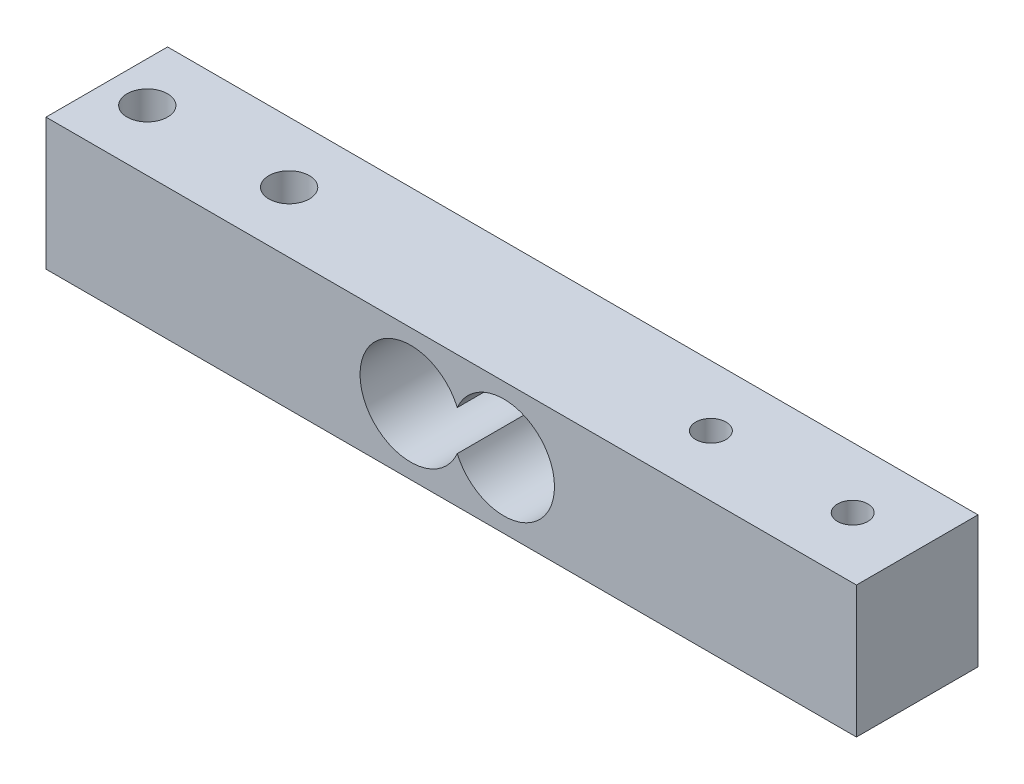
ISO-10303-21;
HEADER;
FILE_DESCRIPTION(('STEP AP214'),'2;1');
FILE_NAME('part.step','',(''),(''),'','','');
FILE_SCHEMA(('AUTOMOTIVE_DESIGN { 1 0 10303 214 1 1 1 1 }'));
ENDSEC;
DATA;
#1=APPLICATION_CONTEXT('core data for automotive mechanical design processes');
#2=APPLICATION_PROTOCOL_DEFINITION('international standard','automotive_design',2000,#1);
#3=PRODUCT_CONTEXT('',#1,'mechanical');
#4=PRODUCT('Part','Part','',(#3));
#5=PRODUCT_RELATED_PRODUCT_CATEGORY('part','',(#4));
#6=PRODUCT_DEFINITION_FORMATION('','',#4);
#7=PRODUCT_DEFINITION_CONTEXT('part definition',#1,'design');
#8=PRODUCT_DEFINITION('design','',#6,#7);
#9=PRODUCT_DEFINITION_SHAPE('','',#8);
#10=(LENGTH_UNIT() NAMED_UNIT(*) SI_UNIT(.MILLI.,.METRE.));
#11=(NAMED_UNIT(*) PLANE_ANGLE_UNIT() SI_UNIT($,.RADIAN.));
#12=(NAMED_UNIT(*) SI_UNIT($,.STERADIAN.) SOLID_ANGLE_UNIT());
#13=UNCERTAINTY_MEASURE_WITH_UNIT(LENGTH_MEASURE(1.E-05),#10,'distance_accuracy_value','');
#14=(GEOMETRIC_REPRESENTATION_CONTEXT(3) GLOBAL_UNCERTAINTY_ASSIGNED_CONTEXT((#13)) GLOBAL_UNIT_ASSIGNED_CONTEXT((#10,
#11,#12)) REPRESENTATION_CONTEXT('',''));
#15=CARTESIAN_POINT('',(0.,0.,0.));
#16=DIRECTION('',(0.,0.,1.));
#17=DIRECTION('',(1.,0.,0.));
#18=AXIS2_PLACEMENT_3D('',#15,#16,#17);
#19=CARTESIAN_POINT('',(-40.,13.,-6.));
#20=DIRECTION('',(0.,0.,1.));
#21=DIRECTION('',(1.,0.,0.));
#22=AXIS2_PLACEMENT_3D('',#19,#20,#21);
#23=PLANE('',#22);
#24=DIRECTION('',(-1.,0.,0.));
#25=VECTOR('',#24,1.);
#26=CARTESIAN_POINT('',(-40.,0.,-6.));
#27=LINE('',#26,#25);
#28=CARTESIAN_POINT('',(40.,0.,-6.));
#29=VERTEX_POINT('',#28);
#30=CARTESIAN_POINT('',(-40.,0.,-6.));
#31=VERTEX_POINT('',#30);
#32=EDGE_CURVE('E179',#29,#31,#27,.T.);
#33=ORIENTED_EDGE('',*,*,#32,.T.);
#34=DIRECTION('',(0.,-1.,0.));
#35=VECTOR('',#34,1.);
#36=CARTESIAN_POINT('',(-40.,13.,-6.));
#37=LINE('',#36,#35);
#38=CARTESIAN_POINT('',(-40.,13.,-6.));
#39=VERTEX_POINT('',#38);
#40=EDGE_CURVE('E194',#39,#31,#37,.T.);
#41=ORIENTED_EDGE('',*,*,#40,.F.);
#42=DIRECTION('',(-1.,0.,0.));
#43=VECTOR('',#42,1.);
#44=CARTESIAN_POINT('',(-40.,13.,-6.));
#45=LINE('',#44,#43);
#46=CARTESIAN_POINT('',(40.,13.,-6.));
#47=VERTEX_POINT('',#46);
#48=EDGE_CURVE('E165',#47,#39,#45,.T.);
#49=ORIENTED_EDGE('',*,*,#48,.F.);
#50=DIRECTION('',(0.,-1.,0.));
#51=VECTOR('',#50,1.);
#52=CARTESIAN_POINT('',(40.,13.,-6.));
#53=LINE('',#52,#51);
#54=EDGE_CURVE('E198',#47,#29,#53,.T.);
#55=ORIENTED_EDGE('',*,*,#54,.T.);
#56=EDGE_LOOP('',(#33,#41,#49,#55));
#57=FACE_BOUND('',#56,.T.);
#58=CARTESIAN_POINT('',(5.19354911457308,6.5,-6.));
#59=DIRECTION('',(0.,0.,1.));
#60=DIRECTION('',(1.,0.,0.));
#61=AXIS2_PLACEMENT_3D('',#58,#59,#60);
#62=CIRCLE('',#61,5.);
#63=CARTESIAN_POINT('',(0.596774557286536,8.46714607222827,-6.));
#64=VERTEX_POINT('',#63);
#65=CARTESIAN_POINT('',(0.596774557286534,4.53285392777173,-6.));
#66=VERTEX_POINT('',#65);
#67=EDGE_CURVE('E116',#64,#66,#62,.F.);
#68=ORIENTED_EDGE('',*,*,#67,.F.);
#69=CARTESIAN_POINT('',(-4.00000000000001,6.5,-6.));
#70=DIRECTION('',(0.,0.,1.));
#71=DIRECTION('',(1.,0.,0.));
#72=AXIS2_PLACEMENT_3D('',#69,#70,#71);
#73=CIRCLE('',#72,5.);
#74=EDGE_CURVE('E111',#66,#64,#73,.F.);
#75=ORIENTED_EDGE('',*,*,#74,.F.);
#76=EDGE_LOOP('',(#68,#75));
#77=FACE_BOUND('',#76,.T.);
#78=ADVANCED_FACE('F50',(#57,#77),#23,.F.);
#79=CARTESIAN_POINT('',(-40.,13.,6.));
#80=DIRECTION('',(0.,0.,-1.));
#81=DIRECTION('',(-1.,0.,0.));
#82=AXIS2_PLACEMENT_3D('',#79,#80,#81);
#83=PLANE('',#82);
#84=DIRECTION('',(1.,0.,0.));
#85=VECTOR('',#84,1.);
#86=CARTESIAN_POINT('',(-40.,0.,6.));
#87=LINE('',#86,#85);
#88=CARTESIAN_POINT('',(-40.,0.,6.));
#89=VERTEX_POINT('',#88);
#90=CARTESIAN_POINT('',(40.,0.,6.));
#91=VERTEX_POINT('',#90);
#92=EDGE_CURVE('E166',#89,#91,#87,.T.);
#93=ORIENTED_EDGE('',*,*,#92,.T.);
#94=DIRECTION('',(0.,-1.,0.));
#95=VECTOR('',#94,1.);
#96=CARTESIAN_POINT('',(40.,13.,6.));
#97=LINE('',#96,#95);
#98=CARTESIAN_POINT('',(40.,13.,6.));
#99=VERTEX_POINT('',#98);
#100=EDGE_CURVE('E175',#99,#91,#97,.T.);
#101=ORIENTED_EDGE('',*,*,#100,.F.);
#102=DIRECTION('',(1.,0.,0.));
#103=VECTOR('',#102,1.);
#104=CARTESIAN_POINT('',(-40.,13.,6.));
#105=LINE('',#104,#103);
#106=CARTESIAN_POINT('',(-40.,13.,6.));
#107=VERTEX_POINT('',#106);
#108=EDGE_CURVE('E172',#107,#99,#105,.T.);
#109=ORIENTED_EDGE('',*,*,#108,.F.);
#110=DIRECTION('',(0.,-1.,0.));
#111=VECTOR('',#110,1.);
#112=CARTESIAN_POINT('',(-40.,13.,6.));
#113=LINE('',#112,#111);
#114=EDGE_CURVE('E190',#107,#89,#113,.T.);
#115=ORIENTED_EDGE('',*,*,#114,.T.);
#116=EDGE_LOOP('',(#93,#101,#109,#115));
#117=FACE_BOUND('',#116,.T.);
#118=CARTESIAN_POINT('',(5.19354911457308,6.5,6.));
#119=DIRECTION('',(0.,0.,-1.));
#120=DIRECTION('',(-1.,0.,0.));
#121=AXIS2_PLACEMENT_3D('',#118,#119,#120);
#122=CIRCLE('',#121,5.);
#123=CARTESIAN_POINT('',(0.596774557286535,4.53285392777173,6.));
#124=VERTEX_POINT('',#123);
#125=CARTESIAN_POINT('',(0.596774557286536,8.46714607222827,6.));
#126=VERTEX_POINT('',#125);
#127=EDGE_CURVE('E12',#124,#126,#122,.F.);
#128=ORIENTED_EDGE('',*,*,#127,.F.);
#129=CARTESIAN_POINT('',(-4.00000000000001,6.5,6.));
#130=DIRECTION('',(0.,0.,-1.));
#131=DIRECTION('',(-1.,0.,0.));
#132=AXIS2_PLACEMENT_3D('',#129,#130,#131);
#133=CIRCLE('',#132,5.);
#134=EDGE_CURVE('E59',#126,#124,#133,.F.);
#135=ORIENTED_EDGE('',*,*,#134,.F.);
#136=EDGE_LOOP('',(#128,#135));
#137=FACE_BOUND('',#136,.T.);
#138=ADVANCED_FACE('F204',(#117,#137),#83,.F.);
#139=CARTESIAN_POINT('',(0.,13.,0.));
#140=DIRECTION('',(0.,-1.,0.));
#141=DIRECTION('',(0.,0.,-1.));
#142=AXIS2_PLACEMENT_3D('',#139,#140,#141);
#143=PLANE('',#142);
#144=CARTESIAN_POINT('',(33.6316178140328,13.,0.));
#145=DIRECTION('',(0.,1.,0.));
#146=DIRECTION('',(0.,0.,1.));
#147=AXIS2_PLACEMENT_3D('',#144,#145,#146);
#148=CIRCLE('',#147,1.5);
#149=CARTESIAN_POINT('',(33.6316178140328,13.,1.5));
#150=VERTEX_POINT('',#149);
#151=EDGE_CURVE('E138',#150,#150,#148,.T.);
#152=ORIENTED_EDGE('',*,*,#151,.F.);
#153=EDGE_LOOP('',(#152));
#154=FACE_BOUND('',#153,.T.);
#155=CARTESIAN_POINT('',(-36.,13.,0.));
#156=DIRECTION('',(0.,1.,0.));
#157=DIRECTION('',(0.,0.,1.));
#158=AXIS2_PLACEMENT_3D('',#155,#156,#157);
#159=CIRCLE('',#158,2.);
#160=CARTESIAN_POINT('',(-36.,13.,2.));
#161=VERTEX_POINT('',#160);
#162=EDGE_CURVE('E153',#161,#161,#159,.T.);
#163=ORIENTED_EDGE('',*,*,#162,.F.);
#164=EDGE_LOOP('',(#163));
#165=FACE_BOUND('',#164,.T.);
#166=DIRECTION('',(0.,0.,-1.));
#167=VECTOR('',#166,1.);
#168=CARTESIAN_POINT('',(40.,13.,6.));
#169=LINE('',#168,#167);
#170=EDGE_CURVE('E161',#99,#47,#169,.T.);
#171=ORIENTED_EDGE('',*,*,#170,.T.);
#172=ORIENTED_EDGE('',*,*,#48,.T.);
#173=DIRECTION('',(0.,0.,1.));
#174=VECTOR('',#173,1.);
#175=CARTESIAN_POINT('',(-40.,13.,6.));
#176=LINE('',#175,#174);
#177=EDGE_CURVE('E169',#39,#107,#176,.T.);
#178=ORIENTED_EDGE('',*,*,#177,.T.);
#179=ORIENTED_EDGE('',*,*,#108,.T.);
#180=EDGE_LOOP('',(#171,#172,#178,#179));
#181=FACE_BOUND('',#180,.T.);
#182=CARTESIAN_POINT('',(-22.,13.,0.));
#183=DIRECTION('',(0.,1.,0.));
#184=DIRECTION('',(0.,0.,1.));
#185=AXIS2_PLACEMENT_3D('',#182,#183,#184);
#186=CIRCLE('',#185,2.);
#187=CARTESIAN_POINT('',(-22.,13.,2.));
#188=VERTEX_POINT('',#187);
#189=EDGE_CURVE('E145',#188,#188,#186,.T.);
#190=ORIENTED_EDGE('',*,*,#189,.F.);
#191=EDGE_LOOP('',(#190));
#192=FACE_BOUND('',#191,.T.);
#193=CARTESIAN_POINT('',(19.6316178140328,13.,0.));
#194=DIRECTION('',(0.,1.,0.));
#195=DIRECTION('',(0.,0.,1.));
#196=AXIS2_PLACEMENT_3D('',#193,#194,#195);
#197=CIRCLE('',#196,1.5);
#198=CARTESIAN_POINT('',(19.6316178140328,13.,1.5));
#199=VERTEX_POINT('',#198);
#200=EDGE_CURVE('E131',#199,#199,#197,.T.);
#201=ORIENTED_EDGE('',*,*,#200,.F.);
#202=EDGE_LOOP('',(#201));
#203=FACE_BOUND('',#202,.T.);
#204=ADVANCED_FACE('F206',(#154,#165,#181,#192,#203),#143,.F.);
#205=CARTESIAN_POINT('',(0.,0.,0.));
#206=DIRECTION('',(0.,-1.,0.));
#207=DIRECTION('',(0.,0.,-1.));
#208=AXIS2_PLACEMENT_3D('',#205,#206,#207);
#209=PLANE('',#208);
#210=CARTESIAN_POINT('',(33.6316178140328,0.,0.));
#211=DIRECTION('',(0.,1.,0.));
#212=DIRECTION('',(0.,0.,1.));
#213=AXIS2_PLACEMENT_3D('',#210,#211,#212);
#214=CIRCLE('',#213,1.5);
#215=CARTESIAN_POINT('',(33.6316178140328,0.,1.5));
#216=VERTEX_POINT('',#215);
#217=EDGE_CURVE('E136',#216,#216,#214,.T.);
#218=ORIENTED_EDGE('',*,*,#217,.T.);
#219=EDGE_LOOP('',(#218));
#220=FACE_BOUND('',#219,.T.);
#221=CARTESIAN_POINT('',(-36.,0.,0.));
#222=DIRECTION('',(0.,1.,0.));
#223=DIRECTION('',(0.,0.,1.));
#224=AXIS2_PLACEMENT_3D('',#221,#222,#223);
#225=CIRCLE('',#224,2.);
#226=CARTESIAN_POINT('',(-36.,0.,2.));
#227=VERTEX_POINT('',#226);
#228=EDGE_CURVE('E149',#227,#227,#225,.T.);
#229=ORIENTED_EDGE('',*,*,#228,.T.);
#230=EDGE_LOOP('',(#229));
#231=FACE_BOUND('',#230,.T.);
#232=DIRECTION('',(0.,0.,-1.));
#233=VECTOR('',#232,1.);
#234=CARTESIAN_POINT('',(40.,0.,6.));
#235=LINE('',#234,#233);
#236=EDGE_CURVE('E157',#91,#29,#235,.T.);
#237=ORIENTED_EDGE('',*,*,#236,.F.);
#238=ORIENTED_EDGE('',*,*,#92,.F.);
#239=DIRECTION('',(0.,0.,1.));
#240=VECTOR('',#239,1.);
#241=CARTESIAN_POINT('',(-40.,0.,6.));
#242=LINE('',#241,#240);
#243=EDGE_CURVE('E182',#31,#89,#242,.T.);
#244=ORIENTED_EDGE('',*,*,#243,.F.);
#245=ORIENTED_EDGE('',*,*,#32,.F.);
#246=EDGE_LOOP('',(#237,#238,#244,#245));
#247=FACE_BOUND('',#246,.T.);
#248=CARTESIAN_POINT('',(-22.,0.,0.));
#249=DIRECTION('',(0.,1.,0.));
#250=DIRECTION('',(0.,0.,1.));
#251=AXIS2_PLACEMENT_3D('',#248,#249,#250);
#252=CIRCLE('',#251,2.);
#253=CARTESIAN_POINT('',(-22.,0.,2.));
#254=VERTEX_POINT('',#253);
#255=EDGE_CURVE('E142',#254,#254,#252,.T.);
#256=ORIENTED_EDGE('',*,*,#255,.T.);
#257=EDGE_LOOP('',(#256));
#258=FACE_BOUND('',#257,.T.);
#259=CARTESIAN_POINT('',(19.6316178140328,0.,0.));
#260=DIRECTION('',(0.,1.,0.));
#261=DIRECTION('',(0.,0.,1.));
#262=AXIS2_PLACEMENT_3D('',#259,#260,#261);
#263=CIRCLE('',#262,1.5);
#264=CARTESIAN_POINT('',(19.6316178140328,0.,1.5));
#265=VERTEX_POINT('',#264);
#266=EDGE_CURVE('E125',#265,#265,#263,.T.);
#267=ORIENTED_EDGE('',*,*,#266,.T.);
#268=EDGE_LOOP('',(#267));
#269=FACE_BOUND('',#268,.T.);
#270=ADVANCED_FACE('F213',(#220,#231,#247,#258,#269),#209,.T.);
#271=CARTESIAN_POINT('',(40.,13.,6.));
#272=DIRECTION('',(-1.,0.,0.));
#273=DIRECTION('',(0.,0.,1.));
#274=AXIS2_PLACEMENT_3D('',#271,#272,#273);
#275=PLANE('',#274);
#276=ORIENTED_EDGE('',*,*,#236,.T.);
#277=ORIENTED_EDGE('',*,*,#54,.F.);
#278=ORIENTED_EDGE('',*,*,#170,.F.);
#279=ORIENTED_EDGE('',*,*,#100,.T.);
#280=EDGE_LOOP('',(#276,#277,#278,#279));
#281=FACE_BOUND('',#280,.T.);
#282=ADVANCED_FACE('F52',(#281),#275,.F.);
#283=CARTESIAN_POINT('',(-40.,13.,6.));
#284=DIRECTION('',(1.,0.,0.));
#285=DIRECTION('',(0.,0.,-1.));
#286=AXIS2_PLACEMENT_3D('',#283,#284,#285);
#287=PLANE('',#286);
#288=ORIENTED_EDGE('',*,*,#243,.T.);
#289=ORIENTED_EDGE('',*,*,#114,.F.);
#290=ORIENTED_EDGE('',*,*,#177,.F.);
#291=ORIENTED_EDGE('',*,*,#40,.T.);
#292=EDGE_LOOP('',(#288,#289,#290,#291));
#293=FACE_BOUND('',#292,.T.);
#294=ADVANCED_FACE('F220',(#293),#287,.F.);
#295=CARTESIAN_POINT('',(-36.,13.,0.));
#296=DIRECTION('',(0.,-1.,0.));
#297=DIRECTION('',(0.,0.,-1.));
#298=AXIS2_PLACEMENT_3D('',#295,#296,#297);
#299=CYLINDRICAL_SURFACE('',#298,2.);
#300=ORIENTED_EDGE('',*,*,#162,.T.);
#301=EDGE_LOOP('',(#300));
#302=FACE_BOUND('',#301,.T.);
#303=ORIENTED_EDGE('',*,*,#228,.F.);
#304=EDGE_LOOP('',(#303));
#305=FACE_BOUND('',#304,.T.);
#306=ADVANCED_FACE('F222',(#302,#305),#299,.F.);
#307=CARTESIAN_POINT('',(-22.,13.,0.));
#308=DIRECTION('',(0.,-1.,0.));
#309=DIRECTION('',(0.,0.,-1.));
#310=AXIS2_PLACEMENT_3D('',#307,#308,#309);
#311=CYLINDRICAL_SURFACE('',#310,2.);
#312=ORIENTED_EDGE('',*,*,#189,.T.);
#313=EDGE_LOOP('',(#312));
#314=FACE_BOUND('',#313,.T.);
#315=ORIENTED_EDGE('',*,*,#255,.F.);
#316=EDGE_LOOP('',(#315));
#317=FACE_BOUND('',#316,.T.);
#318=ADVANCED_FACE('F227',(#314,#317),#311,.F.);
#319=CARTESIAN_POINT('',(33.6316178140328,13.,0.));
#320=DIRECTION('',(0.,-1.,0.));
#321=DIRECTION('',(0.,0.,-1.));
#322=AXIS2_PLACEMENT_3D('',#319,#320,#321);
#323=CYLINDRICAL_SURFACE('',#322,1.5);
#324=ORIENTED_EDGE('',*,*,#151,.T.);
#325=EDGE_LOOP('',(#324));
#326=FACE_BOUND('',#325,.T.);
#327=ORIENTED_EDGE('',*,*,#217,.F.);
#328=EDGE_LOOP('',(#327));
#329=FACE_BOUND('',#328,.T.);
#330=ADVANCED_FACE('F253',(#326,#329),#323,.F.);
#331=CARTESIAN_POINT('',(19.6316178140328,13.,0.));
#332=DIRECTION('',(0.,-1.,0.));
#333=DIRECTION('',(0.,0.,-1.));
#334=AXIS2_PLACEMENT_3D('',#331,#332,#333);
#335=CYLINDRICAL_SURFACE('',#334,1.5);
#336=ORIENTED_EDGE('',*,*,#200,.T.);
#337=EDGE_LOOP('',(#336));
#338=FACE_BOUND('',#337,.T.);
#339=ORIENTED_EDGE('',*,*,#266,.F.);
#340=EDGE_LOOP('',(#339));
#341=FACE_BOUND('',#340,.T.);
#342=ADVANCED_FACE('F250',(#338,#341),#335,.F.);
#343=CARTESIAN_POINT('',(5.19354911457308,6.5,6.5));
#344=DIRECTION('',(0.,0.,-1.));
#345=DIRECTION('',(-1.,0.,0.));
#346=AXIS2_PLACEMENT_3D('',#343,#344,#345);
#347=CYLINDRICAL_SURFACE('',#346,5.);
#348=ORIENTED_EDGE('',*,*,#67,.T.);
#349=DIRECTION('',(0.,0.,-1.));
#350=VECTOR('',#349,1.);
#351=CARTESIAN_POINT('',(0.596774557286535,4.53285392777173,0.));
#352=LINE('',#351,#350);
#353=EDGE_CURVE('E69',#66,#124,#352,.F.);
#354=ORIENTED_EDGE('',*,*,#353,.T.);
#355=ORIENTED_EDGE('',*,*,#127,.T.);
#356=DIRECTION('',(0.,0.,-1.));
#357=VECTOR('',#356,1.);
#358=CARTESIAN_POINT('',(0.596774557286536,8.46714607222827,0.));
#359=LINE('',#358,#357);
#360=EDGE_CURVE('E77',#126,#64,#359,.T.);
#361=ORIENTED_EDGE('',*,*,#360,.T.);
#362=EDGE_LOOP('',(#348,#354,#355,#361));
#363=FACE_BOUND('',#362,.T.);
#364=ADVANCED_FACE('F119',(#363),#347,.F.);
#365=CARTESIAN_POINT('',(-4.00000000000001,6.5,6.5));
#366=DIRECTION('',(0.,0.,-1.));
#367=DIRECTION('',(-1.,0.,0.));
#368=AXIS2_PLACEMENT_3D('',#365,#366,#367);
#369=CYLINDRICAL_SURFACE('',#368,5.);
#370=ORIENTED_EDGE('',*,*,#74,.T.);
#371=ORIENTED_EDGE('',*,*,#360,.F.);
#372=ORIENTED_EDGE('',*,*,#134,.T.);
#373=ORIENTED_EDGE('',*,*,#353,.F.);
#374=EDGE_LOOP('',(#370,#371,#372,#373));
#375=FACE_BOUND('',#374,.T.);
#376=ADVANCED_FACE('F112',(#375),#369,.F.);
#377=CLOSED_SHELL('',(#78,#138,#204,#270,#282,#294,#306,#318,#330,#342,#364,#376));
#378=MANIFOLD_SOLID_BREP('B2',#377);
#379=ADVANCED_BREP_SHAPE_REPRESENTATION('',(#18,#378),#14);
#380=SHAPE_DEFINITION_REPRESENTATION(#9,#379);
ENDSEC;
END-ISO-10303-21;
